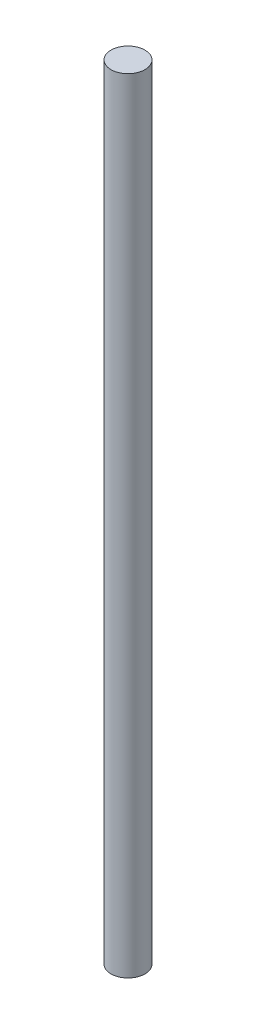
ISO-10303-21;
HEADER;
FILE_DESCRIPTION(('STEP AP214'),'2;1');
FILE_NAME('part.step','',(''),(''),'','','');
FILE_SCHEMA(('AUTOMOTIVE_DESIGN { 1 0 10303 214 1 1 1 1 }'));
ENDSEC;
DATA;
#1=APPLICATION_CONTEXT('core data for automotive mechanical design processes');
#2=APPLICATION_PROTOCOL_DEFINITION('international standard','automotive_design',2000,#1);
#3=PRODUCT_CONTEXT('',#1,'mechanical');
#4=PRODUCT('Part','Part','',(#3));
#5=PRODUCT_RELATED_PRODUCT_CATEGORY('part','',(#4));
#6=PRODUCT_DEFINITION_FORMATION('','',#4);
#7=PRODUCT_DEFINITION_CONTEXT('part definition',#1,'design');
#8=PRODUCT_DEFINITION('design','',#6,#7);
#9=PRODUCT_DEFINITION_SHAPE('','',#8);
#10=(LENGTH_UNIT() NAMED_UNIT(*) SI_UNIT(.MILLI.,.METRE.));
#11=(NAMED_UNIT(*) PLANE_ANGLE_UNIT() SI_UNIT($,.RADIAN.));
#12=(NAMED_UNIT(*) SI_UNIT($,.STERADIAN.) SOLID_ANGLE_UNIT());
#13=UNCERTAINTY_MEASURE_WITH_UNIT(LENGTH_MEASURE(1.E-05),#10,'distance_accuracy_value','');
#14=(GEOMETRIC_REPRESENTATION_CONTEXT(3) GLOBAL_UNCERTAINTY_ASSIGNED_CONTEXT((#13)) GLOBAL_UNIT_ASSIGNED_CONTEXT((#10,
#11,#12)) REPRESENTATION_CONTEXT('',''));
#15=CARTESIAN_POINT('',(0.,0.,0.));
#16=DIRECTION('',(0.,0.,1.));
#17=DIRECTION('',(1.,0.,0.));
#18=AXIS2_PLACEMENT_3D('',#15,#16,#17);
#19=CARTESIAN_POINT('',(0.,60.,0.));
#20=DIRECTION('',(0.,-1.,0.));
#21=DIRECTION('',(0.,0.,-1.));
#22=AXIS2_PLACEMENT_3D('',#19,#20,#21);
#23=CYLINDRICAL_SURFACE('',#22,1.3);
#24=CARTESIAN_POINT('',(0.,60.,0.));
#25=DIRECTION('',(0.,1.,0.));
#26=DIRECTION('',(0.,0.,1.));
#27=AXIS2_PLACEMENT_3D('',#24,#25,#26);
#28=CIRCLE('',#27,1.3);
#29=CARTESIAN_POINT('',(0.,60.,1.3));
#30=VERTEX_POINT('',#29);
#31=EDGE_CURVE('E10',#30,#30,#28,.T.);
#32=ORIENTED_EDGE('',*,*,#31,.F.);
#33=EDGE_LOOP('',(#32));
#34=FACE_BOUND('',#33,.T.);
#35=CARTESIAN_POINT('',(0.,0.,0.));
#36=DIRECTION('',(0.,1.,0.));
#37=DIRECTION('',(0.,0.,1.));
#38=AXIS2_PLACEMENT_3D('',#35,#36,#37);
#39=CIRCLE('',#38,1.3);
#40=CARTESIAN_POINT('',(0.,0.,1.3));
#41=VERTEX_POINT('',#40);
#42=EDGE_CURVE('E34',#41,#41,#39,.T.);
#43=ORIENTED_EDGE('',*,*,#42,.T.);
#44=EDGE_LOOP('',(#43));
#45=FACE_BOUND('',#44,.T.);
#46=ADVANCED_FACE('F31',(#34,#45),#23,.T.);
#47=CARTESIAN_POINT('',(0.,60.,0.));
#48=DIRECTION('',(0.,1.,0.));
#49=DIRECTION('',(0.,0.,1.));
#50=AXIS2_PLACEMENT_3D('',#47,#48,#49);
#51=PLANE('',#50);
#52=ORIENTED_EDGE('',*,*,#31,.T.);
#53=EDGE_LOOP('',(#52));
#54=FACE_BOUND('',#53,.T.);
#55=ADVANCED_FACE('F46',(#54),#51,.T.);
#56=CARTESIAN_POINT('',(0.,0.,0.));
#57=DIRECTION('',(0.,1.,0.));
#58=DIRECTION('',(0.,0.,1.));
#59=AXIS2_PLACEMENT_3D('',#56,#57,#58);
#60=PLANE('',#59);
#61=ORIENTED_EDGE('',*,*,#42,.F.);
#62=EDGE_LOOP('',(#61));
#63=FACE_BOUND('',#62,.T.);
#64=ADVANCED_FACE('F44',(#63),#60,.F.);
#65=CLOSED_SHELL('',(#46,#55,#64));
#66=MANIFOLD_SOLID_BREP('B2',#65);
#67=ADVANCED_BREP_SHAPE_REPRESENTATION('',(#18,#66),#14);
#68=SHAPE_DEFINITION_REPRESENTATION(#9,#67);
ENDSEC;
END-ISO-10303-21;
